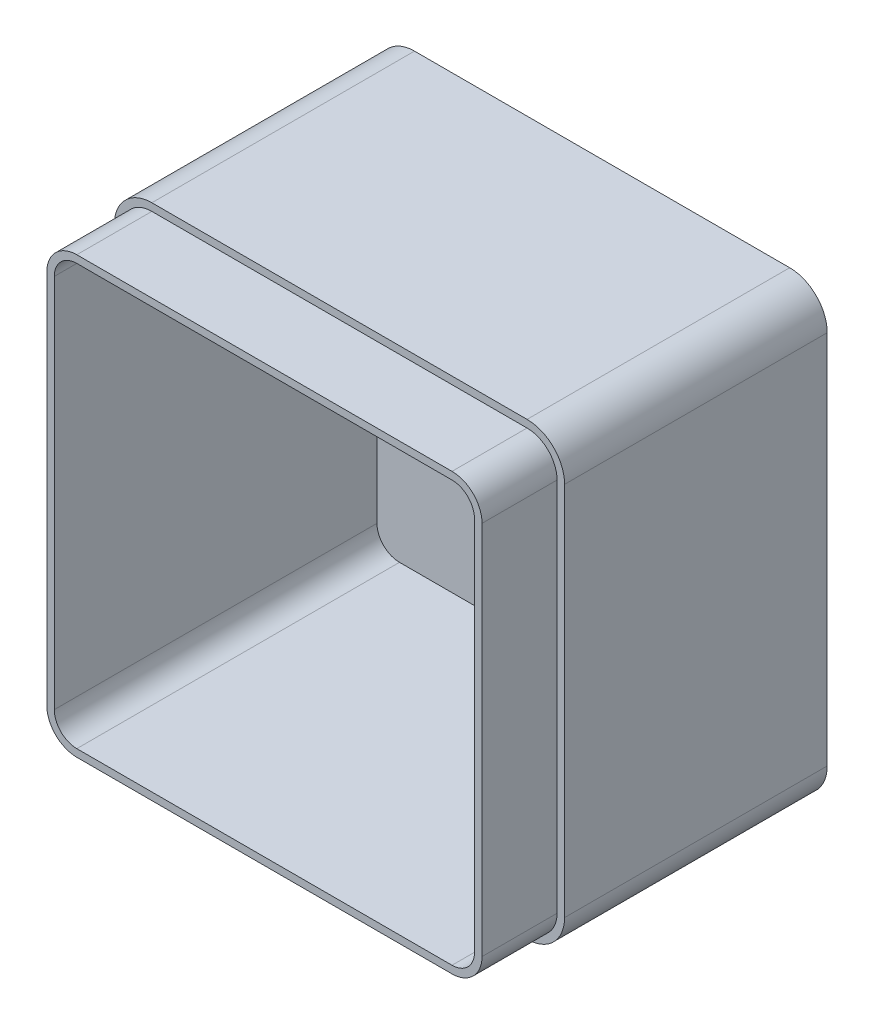
ISO-10303-21;
HEADER;
FILE_DESCRIPTION(('STEP AP214'),'2;1');
FILE_NAME('part.step','',(''),(''),'','','');
FILE_SCHEMA(('AUTOMOTIVE_DESIGN { 1 0 10303 214 1 1 1 1 }'));
ENDSEC;
DATA;
#1=APPLICATION_CONTEXT('core data for automotive mechanical design processes');
#2=APPLICATION_PROTOCOL_DEFINITION('international standard','automotive_design',2000,#1);
#3=PRODUCT_CONTEXT('',#1,'mechanical');
#4=PRODUCT('Part','Part','',(#3));
#5=PRODUCT_RELATED_PRODUCT_CATEGORY('part','',(#4));
#6=PRODUCT_DEFINITION_FORMATION('','',#4);
#7=PRODUCT_DEFINITION_CONTEXT('part definition',#1,'design');
#8=PRODUCT_DEFINITION('design','',#6,#7);
#9=PRODUCT_DEFINITION_SHAPE('','',#8);
#10=(LENGTH_UNIT() NAMED_UNIT(*) SI_UNIT(.MILLI.,.METRE.));
#11=(NAMED_UNIT(*) PLANE_ANGLE_UNIT() SI_UNIT($,.RADIAN.));
#12=(NAMED_UNIT(*) SI_UNIT($,.STERADIAN.) SOLID_ANGLE_UNIT());
#13=UNCERTAINTY_MEASURE_WITH_UNIT(LENGTH_MEASURE(1.E-05),#10,'distance_accuracy_value','');
#14=(GEOMETRIC_REPRESENTATION_CONTEXT(3) GLOBAL_UNCERTAINTY_ASSIGNED_CONTEXT((#13)) GLOBAL_UNIT_ASSIGNED_CONTEXT((#10,
#11,#12)) REPRESENTATION_CONTEXT('',''));
#15=CARTESIAN_POINT('',(0.,0.,0.));
#16=DIRECTION('',(0.,0.,1.));
#17=DIRECTION('',(1.,0.,0.));
#18=AXIS2_PLACEMENT_3D('',#15,#16,#17);
#19=CARTESIAN_POINT('',(0.,0.,90.));
#20=DIRECTION('',(0.,0.,-1.));
#21=DIRECTION('',(-1.,0.,0.));
#22=AXIS2_PLACEMENT_3D('',#19,#20,#21);
#23=PLANE('',#22);
#24=DIRECTION('',(0.,-1.,0.));
#25=VECTOR('',#24,1.);
#26=CARTESIAN_POINT('',(4.,0.,90.));
#27=LINE('',#26,#25);
#28=CARTESIAN_POINT('',(3.99999999999997,110.,90.));
#29=VERTEX_POINT('',#28);
#30=CARTESIAN_POINT('',(4.,10.,90.));
#31=VERTEX_POINT('',#30);
#32=EDGE_CURVE('E347',#29,#31,#27,.T.);
#33=ORIENTED_EDGE('',*,*,#32,.F.);
#34=CARTESIAN_POINT('',(9.99999999999997,110.,90.));
#35=DIRECTION('',(0.,0.,-1.));
#36=DIRECTION('',(-1.,0.,0.));
#37=AXIS2_PLACEMENT_3D('',#34,#35,#36);
#38=CIRCLE('',#37,6.);
#39=CARTESIAN_POINT('',(9.99999999999997,116.,90.));
#40=VERTEX_POINT('',#39);
#41=EDGE_CURVE('E387',#40,#29,#38,.F.);
#42=ORIENTED_EDGE('',*,*,#41,.F.);
#43=DIRECTION('',(-1.,0.,0.));
#44=VECTOR('',#43,1.);
#45=CARTESIAN_POINT('',(0.,116.,90.));
#46=LINE('',#45,#44);
#47=CARTESIAN_POINT('',(110.,116.,90.));
#48=VERTEX_POINT('',#47);
#49=EDGE_CURVE('E363',#48,#40,#46,.T.);
#50=ORIENTED_EDGE('',*,*,#49,.F.);
#51=CARTESIAN_POINT('',(110.,110.,90.));
#52=DIRECTION('',(0.,0.,-1.));
#53=DIRECTION('',(-1.,0.,0.));
#54=AXIS2_PLACEMENT_3D('',#51,#52,#53);
#55=CIRCLE('',#54,6.);
#56=CARTESIAN_POINT('',(116.,110.,90.));
#57=VERTEX_POINT('',#56);
#58=EDGE_CURVE('E327',#57,#48,#55,.F.);
#59=ORIENTED_EDGE('',*,*,#58,.F.);
#60=DIRECTION('',(0.,1.,0.));
#61=VECTOR('',#60,1.);
#62=CARTESIAN_POINT('',(116.,0.,90.));
#63=LINE('',#62,#61);
#64=CARTESIAN_POINT('',(116.,10.,90.));
#65=VERTEX_POINT('',#64);
#66=EDGE_CURVE('E391',#65,#57,#63,.T.);
#67=ORIENTED_EDGE('',*,*,#66,.F.);
#68=CARTESIAN_POINT('',(110.,10.,90.));
#69=DIRECTION('',(0.,0.,-1.));
#70=DIRECTION('',(-1.,0.,0.));
#71=AXIS2_PLACEMENT_3D('',#68,#69,#70);
#72=CIRCLE('',#71,6.);
#73=CARTESIAN_POINT('',(110.,4.,90.));
#74=VERTEX_POINT('',#73);
#75=EDGE_CURVE('E392',#74,#65,#72,.F.);
#76=ORIENTED_EDGE('',*,*,#75,.F.);
#77=DIRECTION('',(1.,0.,0.));
#78=VECTOR('',#77,1.);
#79=CARTESIAN_POINT('',(0.,4.,90.));
#80=LINE('',#79,#78);
#81=CARTESIAN_POINT('',(9.99999999999999,4.,90.));
#82=VERTEX_POINT('',#81);
#83=EDGE_CURVE('E384',#82,#74,#80,.T.);
#84=ORIENTED_EDGE('',*,*,#83,.F.);
#85=CARTESIAN_POINT('',(9.99999999999999,10.,90.));
#86=DIRECTION('',(0.,0.,-1.));
#87=DIRECTION('',(-1.,0.,0.));
#88=AXIS2_PLACEMENT_3D('',#85,#86,#87);
#89=CIRCLE('',#88,6.);
#90=EDGE_CURVE('E377',#31,#82,#89,.F.);
#91=ORIENTED_EDGE('',*,*,#90,.F.);
#92=EDGE_LOOP('',(#33,#42,#50,#59,#67,#76,#84,#91));
#93=FACE_BOUND('',#92,.T.);
#94=CARTESIAN_POINT('',(9.99999999999997,110.,90.));
#95=DIRECTION('',(0.,0.,1.));
#96=DIRECTION('',(1.,0.,0.));
#97=AXIS2_PLACEMENT_3D('',#94,#95,#96);
#98=CIRCLE('',#97,8.);
#99=CARTESIAN_POINT('',(9.99999999999997,118.,90.));
#100=VERTEX_POINT('',#99);
#101=CARTESIAN_POINT('',(1.99999999999997,110.,90.));
#102=VERTEX_POINT('',#101);
#103=EDGE_CURVE('E255',#100,#102,#98,.T.);
#104=ORIENTED_EDGE('',*,*,#103,.T.);
#105=DIRECTION('',(0.,-1.,0.));
#106=VECTOR('',#105,1.);
#107=CARTESIAN_POINT('',(1.99999999999997,110.,90.));
#108=LINE('',#107,#106);
#109=CARTESIAN_POINT('',(1.99999999999997,9.99999999999999,90.));
#110=VERTEX_POINT('',#109);
#111=EDGE_CURVE('E205',#102,#110,#108,.T.);
#112=ORIENTED_EDGE('',*,*,#111,.T.);
#113=CARTESIAN_POINT('',(9.99999999999999,10.,90.));
#114=DIRECTION('',(0.,0.,1.));
#115=DIRECTION('',(1.,0.,0.));
#116=AXIS2_PLACEMENT_3D('',#113,#114,#115);
#117=CIRCLE('',#116,8.00000000000001);
#118=CARTESIAN_POINT('',(9.99999999999999,1.99999999999999,90.));
#119=VERTEX_POINT('',#118);
#120=EDGE_CURVE('E54',#110,#119,#117,.T.);
#121=ORIENTED_EDGE('',*,*,#120,.T.);
#122=DIRECTION('',(1.,0.,0.));
#123=VECTOR('',#122,1.);
#124=CARTESIAN_POINT('',(9.99999999999999,2.,90.));
#125=LINE('',#124,#123);
#126=CARTESIAN_POINT('',(110.,2.,90.));
#127=VERTEX_POINT('',#126);
#128=EDGE_CURVE('E262',#119,#127,#125,.T.);
#129=ORIENTED_EDGE('',*,*,#128,.T.);
#130=CARTESIAN_POINT('',(110.,10.,90.));
#131=DIRECTION('',(0.,0.,1.));
#132=DIRECTION('',(1.,0.,0.));
#133=AXIS2_PLACEMENT_3D('',#130,#131,#132);
#134=CIRCLE('',#133,7.99999999999999);
#135=CARTESIAN_POINT('',(118.,10.,90.));
#136=VERTEX_POINT('',#135);
#137=EDGE_CURVE('E266',#127,#136,#134,.T.);
#138=ORIENTED_EDGE('',*,*,#137,.T.);
#139=DIRECTION('',(0.,1.,0.));
#140=VECTOR('',#139,1.);
#141=CARTESIAN_POINT('',(118.,9.99999999999999,90.));
#142=LINE('',#141,#140);
#143=CARTESIAN_POINT('',(118.,110.,90.));
#144=VERTEX_POINT('',#143);
#145=EDGE_CURVE('E270',#136,#144,#142,.T.);
#146=ORIENTED_EDGE('',*,*,#145,.T.);
#147=CARTESIAN_POINT('',(110.,110.,90.));
#148=DIRECTION('',(0.,0.,1.));
#149=DIRECTION('',(1.,0.,0.));
#150=AXIS2_PLACEMENT_3D('',#147,#148,#149);
#151=CIRCLE('',#150,8.00000000000001);
#152=CARTESIAN_POINT('',(110.,118.,90.));
#153=VERTEX_POINT('',#152);
#154=EDGE_CURVE('E232',#144,#153,#151,.T.);
#155=ORIENTED_EDGE('',*,*,#154,.T.);
#156=DIRECTION('',(-1.,0.,0.));
#157=VECTOR('',#156,1.);
#158=CARTESIAN_POINT('',(110.,118.,90.));
#159=LINE('',#158,#157);
#160=EDGE_CURVE('E228',#153,#100,#159,.T.);
#161=ORIENTED_EDGE('',*,*,#160,.T.);
#162=EDGE_LOOP('',(#104,#112,#121,#129,#138,#146,#155,#161));
#163=FACE_BOUND('',#162,.T.);
#164=ADVANCED_FACE('F38',(#93,#163),#23,.F.);
#165=CARTESIAN_POINT('',(4.,0.,90.));
#166=DIRECTION('',(1.,0.,0.));
#167=DIRECTION('',(0.,1.,0.));
#168=AXIS2_PLACEMENT_3D('',#165,#166,#167);
#169=PLANE('',#168);
#170=DIRECTION('',(0.,-1.,0.));
#171=VECTOR('',#170,1.);
#172=CARTESIAN_POINT('',(4.,0.,4.));
#173=LINE('',#172,#171);
#174=CARTESIAN_POINT('',(3.99999999999997,110.,4.));
#175=VERTEX_POINT('',#174);
#176=CARTESIAN_POINT('',(4.,10.,4.));
#177=VERTEX_POINT('',#176);
#178=EDGE_CURVE('E319',#175,#177,#173,.T.);
#179=ORIENTED_EDGE('',*,*,#178,.F.);
#180=DIRECTION('',(0.,0.,1.));
#181=VECTOR('',#180,1.);
#182=CARTESIAN_POINT('',(3.99999999999997,110.,90.));
#183=LINE('',#182,#181);
#184=EDGE_CURVE('E328',#29,#175,#183,.F.);
#185=ORIENTED_EDGE('',*,*,#184,.F.);
#186=ORIENTED_EDGE('',*,*,#32,.T.);
#187=DIRECTION('',(0.,0.,1.));
#188=VECTOR('',#187,1.);
#189=CARTESIAN_POINT('',(4.,10.,90.));
#190=LINE('',#189,#188);
#191=EDGE_CURVE('E324',#177,#31,#190,.T.);
#192=ORIENTED_EDGE('',*,*,#191,.F.);
#193=EDGE_LOOP('',(#179,#185,#186,#192));
#194=FACE_BOUND('',#193,.T.);
#195=ADVANCED_FACE('F504',(#194),#169,.T.);
#196=CARTESIAN_POINT('',(0.,4.,90.));
#197=DIRECTION('',(0.,1.,0.));
#198=DIRECTION('',(0.,0.,1.));
#199=AXIS2_PLACEMENT_3D('',#196,#197,#198);
#200=PLANE('',#199);
#201=ORIENTED_EDGE('',*,*,#83,.T.);
#202=DIRECTION('',(0.,0.,1.));
#203=VECTOR('',#202,1.);
#204=CARTESIAN_POINT('',(110.,4.,90.));
#205=LINE('',#204,#203);
#206=CARTESIAN_POINT('',(110.,4.,4.));
#207=VERTEX_POINT('',#206);
#208=EDGE_CURVE('E360',#207,#74,#205,.T.);
#209=ORIENTED_EDGE('',*,*,#208,.F.);
#210=DIRECTION('',(1.,0.,0.));
#211=VECTOR('',#210,1.);
#212=CARTESIAN_POINT('',(0.,4.,4.));
#213=LINE('',#212,#211);
#214=CARTESIAN_POINT('',(9.99999999999999,4.,4.));
#215=VERTEX_POINT('',#214);
#216=EDGE_CURVE('E323',#215,#207,#213,.T.);
#217=ORIENTED_EDGE('',*,*,#216,.F.);
#218=DIRECTION('',(0.,0.,1.));
#219=VECTOR('',#218,1.);
#220=CARTESIAN_POINT('',(9.99999999999999,4.,90.));
#221=LINE('',#220,#219);
#222=EDGE_CURVE('E351',#82,#215,#221,.F.);
#223=ORIENTED_EDGE('',*,*,#222,.F.);
#224=EDGE_LOOP('',(#201,#209,#217,#223));
#225=FACE_BOUND('',#224,.T.);
#226=ADVANCED_FACE('F509',(#225),#200,.T.);
#227=CARTESIAN_POINT('',(116.,0.,90.));
#228=DIRECTION('',(-1.,0.,0.));
#229=DIRECTION('',(0.,-1.,0.));
#230=AXIS2_PLACEMENT_3D('',#227,#228,#229);
#231=PLANE('',#230);
#232=ORIENTED_EDGE('',*,*,#66,.T.);
#233=DIRECTION('',(0.,0.,1.));
#234=VECTOR('',#233,1.);
#235=CARTESIAN_POINT('',(116.,110.,90.));
#236=LINE('',#235,#234);
#237=CARTESIAN_POINT('',(116.,110.,4.));
#238=VERTEX_POINT('',#237);
#239=EDGE_CURVE('E369',#238,#57,#236,.T.);
#240=ORIENTED_EDGE('',*,*,#239,.F.);
#241=DIRECTION('',(0.,1.,0.));
#242=VECTOR('',#241,1.);
#243=CARTESIAN_POINT('',(116.,0.,4.));
#244=LINE('',#243,#242);
#245=CARTESIAN_POINT('',(116.,10.,4.));
#246=VERTEX_POINT('',#245);
#247=EDGE_CURVE('E336',#246,#238,#244,.T.);
#248=ORIENTED_EDGE('',*,*,#247,.F.);
#249=DIRECTION('',(0.,0.,1.));
#250=VECTOR('',#249,1.);
#251=CARTESIAN_POINT('',(116.,10.,90.));
#252=LINE('',#251,#250);
#253=EDGE_CURVE('E364',#65,#246,#252,.F.);
#254=ORIENTED_EDGE('',*,*,#253,.F.);
#255=EDGE_LOOP('',(#232,#240,#248,#254));
#256=FACE_BOUND('',#255,.T.);
#257=ADVANCED_FACE('F538',(#256),#231,.T.);
#258=CARTESIAN_POINT('',(0.,116.,90.));
#259=DIRECTION('',(0.,-1.,0.));
#260=DIRECTION('',(0.,0.,-1.));
#261=AXIS2_PLACEMENT_3D('',#258,#259,#260);
#262=PLANE('',#261);
#263=DIRECTION('',(-1.,0.,0.));
#264=VECTOR('',#263,1.);
#265=CARTESIAN_POINT('',(0.,116.,4.));
#266=LINE('',#265,#264);
#267=CARTESIAN_POINT('',(110.,116.,4.));
#268=VERTEX_POINT('',#267);
#269=CARTESIAN_POINT('',(9.99999999999997,116.,4.));
#270=VERTEX_POINT('',#269);
#271=EDGE_CURVE('E343',#268,#270,#266,.T.);
#272=ORIENTED_EDGE('',*,*,#271,.F.);
#273=DIRECTION('',(0.,0.,-1.));
#274=VECTOR('',#273,1.);
#275=CARTESIAN_POINT('',(110.,116.,90.));
#276=LINE('',#275,#274);
#277=EDGE_CURVE('E373',#48,#268,#276,.T.);
#278=ORIENTED_EDGE('',*,*,#277,.F.);
#279=ORIENTED_EDGE('',*,*,#49,.T.);
#280=DIRECTION('',(0.,0.,-1.));
#281=VECTOR('',#280,1.);
#282=CARTESIAN_POINT('',(9.99999999999997,116.,90.));
#283=LINE('',#282,#281);
#284=EDGE_CURVE('E372',#270,#40,#283,.F.);
#285=ORIENTED_EDGE('',*,*,#284,.F.);
#286=EDGE_LOOP('',(#272,#278,#279,#285));
#287=FACE_BOUND('',#286,.T.);
#288=ADVANCED_FACE('F534',(#287),#262,.T.);
#289=CARTESIAN_POINT('',(0.,0.,4.));
#290=DIRECTION('',(0.,0.,-1.));
#291=DIRECTION('',(-1.,0.,0.));
#292=AXIS2_PLACEMENT_3D('',#289,#290,#291);
#293=PLANE('',#292);
#294=ORIENTED_EDGE('',*,*,#216,.T.);
#295=CARTESIAN_POINT('',(110.,10.,4.));
#296=DIRECTION('',(0.,0.,-1.));
#297=DIRECTION('',(-1.,0.,0.));
#298=AXIS2_PLACEMENT_3D('',#295,#296,#297);
#299=CIRCLE('',#298,6.);
#300=EDGE_CURVE('E342',#246,#207,#299,.T.);
#301=ORIENTED_EDGE('',*,*,#300,.F.);
#302=ORIENTED_EDGE('',*,*,#247,.T.);
#303=CARTESIAN_POINT('',(110.,110.,4.));
#304=DIRECTION('',(0.,0.,-1.));
#305=DIRECTION('',(-1.,0.,0.));
#306=AXIS2_PLACEMENT_3D('',#303,#304,#305);
#307=CIRCLE('',#306,6.);
#308=EDGE_CURVE('E348',#268,#238,#307,.T.);
#309=ORIENTED_EDGE('',*,*,#308,.F.);
#310=ORIENTED_EDGE('',*,*,#271,.T.);
#311=CARTESIAN_POINT('',(9.99999999999997,110.,4.));
#312=DIRECTION('',(0.,0.,-1.));
#313=DIRECTION('',(-1.,0.,0.));
#314=AXIS2_PLACEMENT_3D('',#311,#312,#313);
#315=CIRCLE('',#314,6.);
#316=EDGE_CURVE('E339',#175,#270,#315,.T.);
#317=ORIENTED_EDGE('',*,*,#316,.F.);
#318=ORIENTED_EDGE('',*,*,#178,.T.);
#319=CARTESIAN_POINT('',(9.99999999999999,10.,4.));
#320=DIRECTION('',(0.,0.,-1.));
#321=DIRECTION('',(-1.,0.,0.));
#322=AXIS2_PLACEMENT_3D('',#319,#320,#321);
#323=CIRCLE('',#322,6.);
#324=EDGE_CURVE('E332',#215,#177,#323,.T.);
#325=ORIENTED_EDGE('',*,*,#324,.F.);
#326=EDGE_LOOP('',(#294,#301,#302,#309,#310,#317,#318,#325));
#327=FACE_BOUND('',#326,.T.);
#328=ADVANCED_FACE('F530',(#327),#293,.F.);
#329=CARTESIAN_POINT('',(9.99999999999999,10.,90.));
#330=DIRECTION('',(0.,0.,-1.));
#331=DIRECTION('',(-1.,0.,0.));
#332=AXIS2_PLACEMENT_3D('',#329,#330,#331);
#333=CYLINDRICAL_SURFACE('',#332,6.);
#334=ORIENTED_EDGE('',*,*,#90,.T.);
#335=ORIENTED_EDGE('',*,*,#222,.T.);
#336=ORIENTED_EDGE('',*,*,#324,.T.);
#337=ORIENTED_EDGE('',*,*,#191,.T.);
#338=EDGE_LOOP('',(#334,#335,#336,#337));
#339=FACE_BOUND('',#338,.T.);
#340=ADVANCED_FACE('F526',(#339),#333,.F.);
#341=CARTESIAN_POINT('',(9.99999999999997,110.,90.));
#342=DIRECTION('',(0.,0.,-1.));
#343=DIRECTION('',(-1.,0.,0.));
#344=AXIS2_PLACEMENT_3D('',#341,#342,#343);
#345=CYLINDRICAL_SURFACE('',#344,6.);
#346=ORIENTED_EDGE('',*,*,#41,.T.);
#347=ORIENTED_EDGE('',*,*,#184,.T.);
#348=ORIENTED_EDGE('',*,*,#316,.T.);
#349=ORIENTED_EDGE('',*,*,#284,.T.);
#350=EDGE_LOOP('',(#346,#347,#348,#349));
#351=FACE_BOUND('',#350,.T.);
#352=ADVANCED_FACE('F522',(#351),#345,.F.);
#353=CARTESIAN_POINT('',(110.,10.,90.));
#354=DIRECTION('',(0.,0.,-1.));
#355=DIRECTION('',(-1.,0.,0.));
#356=AXIS2_PLACEMENT_3D('',#353,#354,#355);
#357=CYLINDRICAL_SURFACE('',#356,6.);
#358=ORIENTED_EDGE('',*,*,#75,.T.);
#359=ORIENTED_EDGE('',*,*,#253,.T.);
#360=ORIENTED_EDGE('',*,*,#300,.T.);
#361=ORIENTED_EDGE('',*,*,#208,.T.);
#362=EDGE_LOOP('',(#358,#359,#360,#361));
#363=FACE_BOUND('',#362,.T.);
#364=ADVANCED_FACE('F518',(#363),#357,.F.);
#365=CARTESIAN_POINT('',(110.,110.,90.));
#366=DIRECTION('',(0.,0.,-1.));
#367=DIRECTION('',(-1.,0.,0.));
#368=AXIS2_PLACEMENT_3D('',#365,#366,#367);
#369=CYLINDRICAL_SURFACE('',#368,6.);
#370=ORIENTED_EDGE('',*,*,#58,.T.);
#371=ORIENTED_EDGE('',*,*,#277,.T.);
#372=ORIENTED_EDGE('',*,*,#308,.T.);
#373=ORIENTED_EDGE('',*,*,#239,.T.);
#374=EDGE_LOOP('',(#370,#371,#372,#373));
#375=FACE_BOUND('',#374,.T.);
#376=ADVANCED_FACE('F515',(#375),#369,.F.);
#377=CARTESIAN_POINT('',(9.99999999999997,110.,70.));
#378=DIRECTION('',(0.,0.,1.));
#379=DIRECTION('',(1.,0.,0.));
#380=AXIS2_PLACEMENT_3D('',#377,#378,#379);
#381=PLANE('',#380);
#382=DIRECTION('',(-1.,0.,0.));
#383=VECTOR('',#382,1.);
#384=CARTESIAN_POINT('',(110.,118.,70.));
#385=LINE('',#384,#383);
#386=CARTESIAN_POINT('',(110.,118.,70.));
#387=VERTEX_POINT('',#386);
#388=CARTESIAN_POINT('',(9.99999999999997,118.,70.));
#389=VERTEX_POINT('',#388);
#390=EDGE_CURVE('E212',#387,#389,#385,.T.);
#391=ORIENTED_EDGE('',*,*,#390,.F.);
#392=CARTESIAN_POINT('',(110.,110.,70.));
#393=DIRECTION('',(0.,0.,1.));
#394=DIRECTION('',(1.,0.,0.));
#395=AXIS2_PLACEMENT_3D('',#392,#393,#394);
#396=CIRCLE('',#395,8.00000000000001);
#397=CARTESIAN_POINT('',(118.,110.,70.));
#398=VERTEX_POINT('',#397);
#399=EDGE_CURVE('E249',#398,#387,#396,.T.);
#400=ORIENTED_EDGE('',*,*,#399,.F.);
#401=DIRECTION('',(0.,1.,0.));
#402=VECTOR('',#401,1.);
#403=CARTESIAN_POINT('',(118.,9.99999999999999,70.));
#404=LINE('',#403,#402);
#405=CARTESIAN_POINT('',(118.,10.,70.));
#406=VERTEX_POINT('',#405);
#407=EDGE_CURVE('E245',#406,#398,#404,.T.);
#408=ORIENTED_EDGE('',*,*,#407,.F.);
#409=CARTESIAN_POINT('',(110.,10.,70.));
#410=DIRECTION('',(0.,0.,1.));
#411=DIRECTION('',(1.,0.,0.));
#412=AXIS2_PLACEMENT_3D('',#409,#410,#411);
#413=CIRCLE('',#412,7.99999999999999);
#414=CARTESIAN_POINT('',(110.,2.,70.));
#415=VERTEX_POINT('',#414);
#416=EDGE_CURVE('E241',#415,#406,#413,.T.);
#417=ORIENTED_EDGE('',*,*,#416,.F.);
#418=DIRECTION('',(1.,0.,0.));
#419=VECTOR('',#418,1.);
#420=CARTESIAN_POINT('',(9.99999999999999,2.,70.));
#421=LINE('',#420,#419);
#422=CARTESIAN_POINT('',(9.99999999999999,1.99999999999999,70.));
#423=VERTEX_POINT('',#422);
#424=EDGE_CURVE('E237',#423,#415,#421,.T.);
#425=ORIENTED_EDGE('',*,*,#424,.F.);
#426=CARTESIAN_POINT('',(9.99999999999999,10.,70.));
#427=DIRECTION('',(0.,0.,1.));
#428=DIRECTION('',(1.,0.,0.));
#429=AXIS2_PLACEMENT_3D('',#426,#427,#428);
#430=CIRCLE('',#429,8.00000000000001);
#431=CARTESIAN_POINT('',(1.99999999999997,9.99999999999999,70.));
#432=VERTEX_POINT('',#431);
#433=EDGE_CURVE('E222',#432,#423,#430,.T.);
#434=ORIENTED_EDGE('',*,*,#433,.F.);
#435=DIRECTION('',(0.,-1.,0.));
#436=VECTOR('',#435,1.);
#437=CARTESIAN_POINT('',(1.99999999999997,110.,70.));
#438=LINE('',#437,#436);
#439=CARTESIAN_POINT('',(1.99999999999997,110.,70.));
#440=VERTEX_POINT('',#439);
#441=EDGE_CURVE('E203',#440,#432,#438,.T.);
#442=ORIENTED_EDGE('',*,*,#441,.F.);
#443=CARTESIAN_POINT('',(9.99999999999997,110.,70.));
#444=DIRECTION('',(0.,0.,1.));
#445=DIRECTION('',(1.,0.,0.));
#446=AXIS2_PLACEMENT_3D('',#443,#444,#445);
#447=CIRCLE('',#446,8.);
#448=EDGE_CURVE('E218',#389,#440,#447,.T.);
#449=ORIENTED_EDGE('',*,*,#448,.F.);
#450=EDGE_LOOP('',(#391,#400,#408,#417,#425,#434,#442,#449));
#451=FACE_BOUND('',#450,.T.);
#452=CARTESIAN_POINT('',(9.99999999999997,110.,70.));
#453=DIRECTION('',(0.,0.,1.));
#454=DIRECTION('',(1.,0.,0.));
#455=AXIS2_PLACEMENT_3D('',#452,#453,#454);
#456=CIRCLE('',#455,10.);
#457=CARTESIAN_POINT('',(9.99999999999997,120.,70.));
#458=VERTEX_POINT('',#457);
#459=CARTESIAN_POINT('',(0.,110.,70.));
#460=VERTEX_POINT('',#459);
#461=EDGE_CURVE('E279',#458,#460,#456,.T.);
#462=ORIENTED_EDGE('',*,*,#461,.T.);
#463=DIRECTION('',(0.,-1.,0.));
#464=VECTOR('',#463,1.);
#465=CARTESIAN_POINT('',(0.,110.,70.));
#466=LINE('',#465,#464);
#467=CARTESIAN_POINT('',(0.,10.,70.));
#468=VERTEX_POINT('',#467);
#469=EDGE_CURVE('E299',#460,#468,#466,.T.);
#470=ORIENTED_EDGE('',*,*,#469,.T.);
#471=CARTESIAN_POINT('',(9.99999999999999,10.,70.));
#472=DIRECTION('',(0.,0.,1.));
#473=DIRECTION('',(1.,0.,0.));
#474=AXIS2_PLACEMENT_3D('',#471,#472,#473);
#475=CIRCLE('',#474,10.);
#476=CARTESIAN_POINT('',(9.99999999999999,0.,70.));
#477=VERTEX_POINT('',#476);
#478=EDGE_CURVE('E302',#468,#477,#475,.T.);
#479=ORIENTED_EDGE('',*,*,#478,.T.);
#480=DIRECTION('',(1.,0.,0.));
#481=VECTOR('',#480,1.);
#482=CARTESIAN_POINT('',(9.99999999999999,0.,70.));
#483=LINE('',#482,#481);
#484=CARTESIAN_POINT('',(110.,0.,70.));
#485=VERTEX_POINT('',#484);
#486=EDGE_CURVE('E305',#477,#485,#483,.T.);
#487=ORIENTED_EDGE('',*,*,#486,.T.);
#488=CARTESIAN_POINT('',(110.,10.,70.));
#489=DIRECTION('',(0.,0.,1.));
#490=DIRECTION('',(1.,0.,0.));
#491=AXIS2_PLACEMENT_3D('',#488,#489,#490);
#492=CIRCLE('',#491,9.99999999999999);
#493=CARTESIAN_POINT('',(120.,10.,70.));
#494=VERTEX_POINT('',#493);
#495=EDGE_CURVE('E308',#485,#494,#492,.T.);
#496=ORIENTED_EDGE('',*,*,#495,.T.);
#497=DIRECTION('',(0.,1.,0.));
#498=VECTOR('',#497,1.);
#499=CARTESIAN_POINT('',(120.,10.,70.));
#500=LINE('',#499,#498);
#501=CARTESIAN_POINT('',(120.,110.,70.));
#502=VERTEX_POINT('',#501);
#503=EDGE_CURVE('E62',#494,#502,#500,.T.);
#504=ORIENTED_EDGE('',*,*,#503,.T.);
#505=CARTESIAN_POINT('',(110.,110.,70.));
#506=DIRECTION('',(0.,0.,1.));
#507=DIRECTION('',(1.,0.,0.));
#508=AXIS2_PLACEMENT_3D('',#505,#506,#507);
#509=CIRCLE('',#508,9.99999999999999);
#510=CARTESIAN_POINT('',(110.,120.,70.));
#511=VERTEX_POINT('',#510);
#512=EDGE_CURVE('E313',#502,#511,#509,.T.);
#513=ORIENTED_EDGE('',*,*,#512,.T.);
#514=DIRECTION('',(-1.,0.,0.));
#515=VECTOR('',#514,1.);
#516=CARTESIAN_POINT('',(110.,120.,70.));
#517=LINE('',#516,#515);
#518=EDGE_CURVE('E316',#511,#458,#517,.T.);
#519=ORIENTED_EDGE('',*,*,#518,.T.);
#520=EDGE_LOOP('',(#462,#470,#479,#487,#496,#504,#513,#519));
#521=FACE_BOUND('',#520,.T.);
#522=ADVANCED_FACE('F217',(#451,#521),#381,.T.);
#523=CARTESIAN_POINT('',(9.99999999999997,110.,70.));
#524=DIRECTION('',(0.,0.,1.));
#525=DIRECTION('',(1.,0.,0.));
#526=AXIS2_PLACEMENT_3D('',#523,#524,#525);
#527=CYLINDRICAL_SURFACE('',#526,8.);
#528=ORIENTED_EDGE('',*,*,#103,.F.);
#529=DIRECTION('',(0.,0.,1.));
#530=VECTOR('',#529,1.);
#531=CARTESIAN_POINT('',(9.99999999999997,118.,70.));
#532=LINE('',#531,#530);
#533=EDGE_CURVE('E226',#389,#100,#532,.T.);
#534=ORIENTED_EDGE('',*,*,#533,.F.);
#535=ORIENTED_EDGE('',*,*,#448,.T.);
#536=DIRECTION('',(0.,0.,1.));
#537=VECTOR('',#536,1.);
#538=CARTESIAN_POINT('',(1.99999999999997,110.,70.));
#539=LINE('',#538,#537);
#540=EDGE_CURVE('E200',#440,#102,#539,.T.);
#541=ORIENTED_EDGE('',*,*,#540,.T.);
#542=EDGE_LOOP('',(#528,#534,#535,#541));
#543=FACE_BOUND('',#542,.T.);
#544=ADVANCED_FACE('F225',(#543),#527,.T.);
#545=CARTESIAN_POINT('',(110.,118.,70.));
#546=DIRECTION('',(0.,1.,0.));
#547=DIRECTION('',(0.,0.,1.));
#548=AXIS2_PLACEMENT_3D('',#545,#546,#547);
#549=PLANE('',#548);
#550=ORIENTED_EDGE('',*,*,#160,.F.);
#551=DIRECTION('',(0.,0.,1.));
#552=VECTOR('',#551,1.);
#553=CARTESIAN_POINT('',(110.,118.,70.));
#554=LINE('',#553,#552);
#555=EDGE_CURVE('E280',#387,#153,#554,.T.);
#556=ORIENTED_EDGE('',*,*,#555,.F.);
#557=ORIENTED_EDGE('',*,*,#390,.T.);
#558=ORIENTED_EDGE('',*,*,#533,.T.);
#559=EDGE_LOOP('',(#550,#556,#557,#558));
#560=FACE_BOUND('',#559,.T.);
#561=ADVANCED_FACE('F549',(#560),#549,.T.);
#562=CARTESIAN_POINT('',(110.,110.,70.));
#563=DIRECTION('',(0.,0.,1.));
#564=DIRECTION('',(1.,0.,0.));
#565=AXIS2_PLACEMENT_3D('',#562,#563,#564);
#566=CYLINDRICAL_SURFACE('',#565,8.00000000000001);
#567=ORIENTED_EDGE('',*,*,#154,.F.);
#568=DIRECTION('',(0.,0.,1.));
#569=VECTOR('',#568,1.);
#570=CARTESIAN_POINT('',(118.,110.,70.));
#571=LINE('',#570,#569);
#572=EDGE_CURVE('E283',#398,#144,#571,.T.);
#573=ORIENTED_EDGE('',*,*,#572,.F.);
#574=ORIENTED_EDGE('',*,*,#399,.T.);
#575=ORIENTED_EDGE('',*,*,#555,.T.);
#576=EDGE_LOOP('',(#567,#573,#574,#575));
#577=FACE_BOUND('',#576,.T.);
#578=ADVANCED_FACE('F564',(#577),#566,.T.);
#579=CARTESIAN_POINT('',(118.,9.99999999999999,70.));
#580=DIRECTION('',(1.,0.,0.));
#581=DIRECTION('',(0.,0.,-1.));
#582=AXIS2_PLACEMENT_3D('',#579,#580,#581);
#583=PLANE('',#582);
#584=ORIENTED_EDGE('',*,*,#145,.F.);
#585=DIRECTION('',(0.,0.,1.));
#586=VECTOR('',#585,1.);
#587=CARTESIAN_POINT('',(118.,10.,70.));
#588=LINE('',#587,#586);
#589=EDGE_CURVE('E286',#406,#136,#588,.T.);
#590=ORIENTED_EDGE('',*,*,#589,.F.);
#591=ORIENTED_EDGE('',*,*,#407,.T.);
#592=ORIENTED_EDGE('',*,*,#572,.T.);
#593=EDGE_LOOP('',(#584,#590,#591,#592));
#594=FACE_BOUND('',#593,.T.);
#595=ADVANCED_FACE('F560',(#594),#583,.T.);
#596=CARTESIAN_POINT('',(110.,10.,70.));
#597=DIRECTION('',(0.,0.,1.));
#598=DIRECTION('',(1.,0.,0.));
#599=AXIS2_PLACEMENT_3D('',#596,#597,#598);
#600=CYLINDRICAL_SURFACE('',#599,7.99999999999999);
#601=ORIENTED_EDGE('',*,*,#137,.F.);
#602=DIRECTION('',(0.,0.,1.));
#603=VECTOR('',#602,1.);
#604=CARTESIAN_POINT('',(110.,2.,70.));
#605=LINE('',#604,#603);
#606=EDGE_CURVE('E289',#415,#127,#605,.T.);
#607=ORIENTED_EDGE('',*,*,#606,.F.);
#608=ORIENTED_EDGE('',*,*,#416,.T.);
#609=ORIENTED_EDGE('',*,*,#589,.T.);
#610=EDGE_LOOP('',(#601,#607,#608,#609));
#611=FACE_BOUND('',#610,.T.);
#612=ADVANCED_FACE('F556',(#611),#600,.T.);
#613=CARTESIAN_POINT('',(9.99999999999999,2.,70.));
#614=DIRECTION('',(0.,-1.,0.));
#615=DIRECTION('',(0.,0.,-1.));
#616=AXIS2_PLACEMENT_3D('',#613,#614,#615);
#617=PLANE('',#616);
#618=ORIENTED_EDGE('',*,*,#128,.F.);
#619=DIRECTION('',(0.,0.,1.));
#620=VECTOR('',#619,1.);
#621=CARTESIAN_POINT('',(9.99999999999999,1.99999999999999,70.));
#622=LINE('',#621,#620);
#623=EDGE_CURVE('E292',#423,#119,#622,.T.);
#624=ORIENTED_EDGE('',*,*,#623,.F.);
#625=ORIENTED_EDGE('',*,*,#424,.T.);
#626=ORIENTED_EDGE('',*,*,#606,.T.);
#627=EDGE_LOOP('',(#618,#624,#625,#626));
#628=FACE_BOUND('',#627,.T.);
#629=ADVANCED_FACE('F553',(#628),#617,.T.);
#630=CARTESIAN_POINT('',(9.99999999999999,10.,70.));
#631=DIRECTION('',(0.,0.,1.));
#632=DIRECTION('',(1.,0.,0.));
#633=AXIS2_PLACEMENT_3D('',#630,#631,#632);
#634=CYLINDRICAL_SURFACE('',#633,8.00000000000001);
#635=ORIENTED_EDGE('',*,*,#120,.F.);
#636=DIRECTION('',(0.,0.,1.));
#637=VECTOR('',#636,1.);
#638=CARTESIAN_POINT('',(1.99999999999997,9.99999999999999,70.));
#639=LINE('',#638,#637);
#640=EDGE_CURVE('E211',#432,#110,#639,.T.);
#641=ORIENTED_EDGE('',*,*,#640,.F.);
#642=ORIENTED_EDGE('',*,*,#433,.T.);
#643=ORIENTED_EDGE('',*,*,#623,.T.);
#644=EDGE_LOOP('',(#635,#641,#642,#643));
#645=FACE_BOUND('',#644,.T.);
#646=ADVANCED_FACE('F499',(#645),#634,.T.);
#647=CARTESIAN_POINT('',(1.99999999999997,110.,70.));
#648=DIRECTION('',(-1.,0.,0.));
#649=DIRECTION('',(0.,0.,1.));
#650=AXIS2_PLACEMENT_3D('',#647,#648,#649);
#651=PLANE('',#650);
#652=ORIENTED_EDGE('',*,*,#111,.F.);
#653=ORIENTED_EDGE('',*,*,#540,.F.);
#654=ORIENTED_EDGE('',*,*,#441,.T.);
#655=ORIENTED_EDGE('',*,*,#640,.T.);
#656=EDGE_LOOP('',(#652,#653,#654,#655));
#657=FACE_BOUND('',#656,.T.);
#658=ADVANCED_FACE('F202',(#657),#651,.T.);
#659=CARTESIAN_POINT('',(0.,0.,0.));
#660=DIRECTION('',(0.,0.,-1.));
#661=DIRECTION('',(-1.,0.,0.));
#662=AXIS2_PLACEMENT_3D('',#659,#660,#661);
#663=PLANE('',#662);
#664=DIRECTION('',(1.,0.,0.));
#665=VECTOR('',#664,1.);
#666=CARTESIAN_POINT('',(0.,0.,0.));
#667=LINE('',#666,#665);
#668=CARTESIAN_POINT('',(9.99999999999999,0.,0.));
#669=VERTEX_POINT('',#668);
#670=CARTESIAN_POINT('',(110.,0.,0.));
#671=VERTEX_POINT('',#670);
#672=EDGE_CURVE('E407',#669,#671,#667,.T.);
#673=ORIENTED_EDGE('',*,*,#672,.F.);
#674=CARTESIAN_POINT('',(9.99999999999999,10.,0.));
#675=DIRECTION('',(0.,0.,-1.));
#676=DIRECTION('',(-1.,0.,0.));
#677=AXIS2_PLACEMENT_3D('',#674,#675,#676);
#678=CIRCLE('',#677,10.);
#679=CARTESIAN_POINT('',(0.,10.,0.));
#680=VERTEX_POINT('',#679);
#681=EDGE_CURVE('E435',#669,#680,#678,.T.);
#682=ORIENTED_EDGE('',*,*,#681,.T.);
#683=DIRECTION('',(0.,-1.,0.));
#684=VECTOR('',#683,1.);
#685=CARTESIAN_POINT('',(0.,0.,0.));
#686=LINE('',#685,#684);
#687=CARTESIAN_POINT('',(0.,110.,0.));
#688=VERTEX_POINT('',#687);
#689=EDGE_CURVE('E368',#688,#680,#686,.T.);
#690=ORIENTED_EDGE('',*,*,#689,.F.);
#691=CARTESIAN_POINT('',(9.99999999999997,110.,0.));
#692=DIRECTION('',(0.,0.,-1.));
#693=DIRECTION('',(-1.,0.,0.));
#694=AXIS2_PLACEMENT_3D('',#691,#692,#693);
#695=CIRCLE('',#694,10.);
#696=CARTESIAN_POINT('',(9.99999999999997,120.,0.));
#697=VERTEX_POINT('',#696);
#698=EDGE_CURVE('E432',#688,#697,#695,.T.);
#699=ORIENTED_EDGE('',*,*,#698,.T.);
#700=DIRECTION('',(-1.,0.,0.));
#701=VECTOR('',#700,1.);
#702=CARTESIAN_POINT('',(0.,120.,0.));
#703=LINE('',#702,#701);
#704=CARTESIAN_POINT('',(110.,120.,0.));
#705=VERTEX_POINT('',#704);
#706=EDGE_CURVE('E415',#705,#697,#703,.T.);
#707=ORIENTED_EDGE('',*,*,#706,.F.);
#708=CARTESIAN_POINT('',(110.,110.,0.));
#709=DIRECTION('',(0.,0.,-1.));
#710=DIRECTION('',(-1.,0.,0.));
#711=AXIS2_PLACEMENT_3D('',#708,#709,#710);
#712=CIRCLE('',#711,10.);
#713=CARTESIAN_POINT('',(120.,110.,0.));
#714=VERTEX_POINT('',#713);
#715=EDGE_CURVE('E426',#705,#714,#712,.T.);
#716=ORIENTED_EDGE('',*,*,#715,.T.);
#717=DIRECTION('',(0.,1.,0.));
#718=VECTOR('',#717,1.);
#719=CARTESIAN_POINT('',(120.,0.,0.));
#720=LINE('',#719,#718);
#721=CARTESIAN_POINT('',(120.,10.,0.));
#722=VERTEX_POINT('',#721);
#723=EDGE_CURVE('E411',#722,#714,#720,.T.);
#724=ORIENTED_EDGE('',*,*,#723,.F.);
#725=CARTESIAN_POINT('',(110.,10.,0.));
#726=DIRECTION('',(0.,0.,-1.));
#727=DIRECTION('',(-1.,0.,0.));
#728=AXIS2_PLACEMENT_3D('',#725,#726,#727);
#729=CIRCLE('',#728,10.);
#730=EDGE_CURVE('E429',#722,#671,#729,.T.);
#731=ORIENTED_EDGE('',*,*,#730,.T.);
#732=EDGE_LOOP('',(#673,#682,#690,#699,#707,#716,#724,#731));
#733=FACE_BOUND('',#732,.T.);
#734=ADVANCED_FACE('F491',(#733),#663,.T.);
#735=CARTESIAN_POINT('',(9.99999999999997,110.,90.));
#736=DIRECTION('',(0.,0.,-1.));
#737=DIRECTION('',(-1.,0.,0.));
#738=AXIS2_PLACEMENT_3D('',#735,#736,#737);
#739=CYLINDRICAL_SURFACE('',#738,10.);
#740=DIRECTION('',(0.,0.,-1.));
#741=VECTOR('',#740,1.);
#742=CARTESIAN_POINT('',(0.,110.,90.));
#743=LINE('',#742,#741);
#744=EDGE_CURVE('E438',#460,#688,#743,.T.);
#745=ORIENTED_EDGE('',*,*,#744,.F.);
#746=ORIENTED_EDGE('',*,*,#461,.F.);
#747=DIRECTION('',(0.,0.,-1.));
#748=VECTOR('',#747,1.);
#749=CARTESIAN_POINT('',(9.99999999999997,120.,90.));
#750=LINE('',#749,#748);
#751=EDGE_CURVE('E448',#697,#458,#750,.F.);
#752=ORIENTED_EDGE('',*,*,#751,.F.);
#753=ORIENTED_EDGE('',*,*,#698,.F.);
#754=EDGE_LOOP('',(#745,#746,#752,#753));
#755=FACE_BOUND('',#754,.T.);
#756=ADVANCED_FACE('F470',(#755),#739,.T.);
#757=CARTESIAN_POINT('',(110.,110.,90.));
#758=DIRECTION('',(0.,0.,-1.));
#759=DIRECTION('',(-1.,0.,0.));
#760=AXIS2_PLACEMENT_3D('',#757,#758,#759);
#761=CYLINDRICAL_SURFACE('',#760,10.);
#762=DIRECTION('',(0.,0.,-1.));
#763=VECTOR('',#762,1.);
#764=CARTESIAN_POINT('',(110.,120.,90.));
#765=LINE('',#764,#763);
#766=EDGE_CURVE('E445',#511,#705,#765,.T.);
#767=ORIENTED_EDGE('',*,*,#766,.F.);
#768=ORIENTED_EDGE('',*,*,#512,.F.);
#769=DIRECTION('',(0.,0.,-1.));
#770=VECTOR('',#769,1.);
#771=CARTESIAN_POINT('',(120.,110.,90.));
#772=LINE('',#771,#770);
#773=EDGE_CURVE('E47',#714,#502,#772,.F.);
#774=ORIENTED_EDGE('',*,*,#773,.F.);
#775=ORIENTED_EDGE('',*,*,#715,.F.);
#776=EDGE_LOOP('',(#767,#768,#774,#775));
#777=FACE_BOUND('',#776,.T.);
#778=ADVANCED_FACE('F40',(#777),#761,.T.);
#779=CARTESIAN_POINT('',(0.,120.,90.));
#780=DIRECTION('',(0.,-1.,0.));
#781=DIRECTION('',(0.,0.,-1.));
#782=AXIS2_PLACEMENT_3D('',#779,#780,#781);
#783=PLANE('',#782);
#784=ORIENTED_EDGE('',*,*,#518,.F.);
#785=ORIENTED_EDGE('',*,*,#766,.T.);
#786=ORIENTED_EDGE('',*,*,#706,.T.);
#787=ORIENTED_EDGE('',*,*,#751,.T.);
#788=EDGE_LOOP('',(#784,#785,#786,#787));
#789=FACE_BOUND('',#788,.T.);
#790=ADVANCED_FACE('F465',(#789),#783,.F.);
#791=CARTESIAN_POINT('',(110.,10.,90.));
#792=DIRECTION('',(0.,0.,-1.));
#793=DIRECTION('',(-1.,0.,0.));
#794=AXIS2_PLACEMENT_3D('',#791,#792,#793);
#795=CYLINDRICAL_SURFACE('',#794,10.);
#796=DIRECTION('',(0.,0.,-1.));
#797=VECTOR('',#796,1.);
#798=CARTESIAN_POINT('',(120.,10.,90.));
#799=LINE('',#798,#797);
#800=EDGE_CURVE('E11',#494,#722,#799,.T.);
#801=ORIENTED_EDGE('',*,*,#800,.F.);
#802=ORIENTED_EDGE('',*,*,#495,.F.);
#803=DIRECTION('',(0.,0.,-1.));
#804=VECTOR('',#803,1.);
#805=CARTESIAN_POINT('',(110.,0.,90.));
#806=LINE('',#805,#804);
#807=EDGE_CURVE('E419',#671,#485,#806,.F.);
#808=ORIENTED_EDGE('',*,*,#807,.F.);
#809=ORIENTED_EDGE('',*,*,#730,.F.);
#810=EDGE_LOOP('',(#801,#802,#808,#809));
#811=FACE_BOUND('',#810,.T.);
#812=ADVANCED_FACE('F489',(#811),#795,.T.);
#813=CARTESIAN_POINT('',(120.,0.,90.));
#814=DIRECTION('',(-1.,0.,0.));
#815=DIRECTION('',(0.,-1.,0.));
#816=AXIS2_PLACEMENT_3D('',#813,#814,#815);
#817=PLANE('',#816);
#818=ORIENTED_EDGE('',*,*,#503,.F.);
#819=ORIENTED_EDGE('',*,*,#800,.T.);
#820=ORIENTED_EDGE('',*,*,#723,.T.);
#821=ORIENTED_EDGE('',*,*,#773,.T.);
#822=EDGE_LOOP('',(#818,#819,#820,#821));
#823=FACE_BOUND('',#822,.T.);
#824=ADVANCED_FACE('F455',(#823),#817,.F.);
#825=CARTESIAN_POINT('',(9.99999999999999,10.,90.));
#826=DIRECTION('',(0.,0.,-1.));
#827=DIRECTION('',(-1.,0.,0.));
#828=AXIS2_PLACEMENT_3D('',#825,#826,#827);
#829=CYLINDRICAL_SURFACE('',#828,10.);
#830=DIRECTION('',(0.,0.,-1.));
#831=VECTOR('',#830,1.);
#832=CARTESIAN_POINT('',(9.99999999999999,0.,90.));
#833=LINE('',#832,#831);
#834=EDGE_CURVE('E423',#477,#669,#833,.T.);
#835=ORIENTED_EDGE('',*,*,#834,.F.);
#836=ORIENTED_EDGE('',*,*,#478,.F.);
#837=DIRECTION('',(0.,0.,-1.));
#838=VECTOR('',#837,1.);
#839=CARTESIAN_POINT('',(0.,10.,90.));
#840=LINE('',#839,#838);
#841=EDGE_CURVE('E441',#680,#468,#840,.F.);
#842=ORIENTED_EDGE('',*,*,#841,.F.);
#843=ORIENTED_EDGE('',*,*,#681,.F.);
#844=EDGE_LOOP('',(#835,#836,#842,#843));
#845=FACE_BOUND('',#844,.T.);
#846=ADVANCED_FACE('F480',(#845),#829,.T.);
#847=CARTESIAN_POINT('',(0.,0.,90.));
#848=DIRECTION('',(0.,1.,0.));
#849=DIRECTION('',(0.,0.,1.));
#850=AXIS2_PLACEMENT_3D('',#847,#848,#849);
#851=PLANE('',#850);
#852=ORIENTED_EDGE('',*,*,#486,.F.);
#853=ORIENTED_EDGE('',*,*,#834,.T.);
#854=ORIENTED_EDGE('',*,*,#672,.T.);
#855=ORIENTED_EDGE('',*,*,#807,.T.);
#856=EDGE_LOOP('',(#852,#853,#854,#855));
#857=FACE_BOUND('',#856,.T.);
#858=ADVANCED_FACE('F485',(#857),#851,.F.);
#859=CARTESIAN_POINT('',(0.,0.,90.));
#860=DIRECTION('',(1.,0.,0.));
#861=DIRECTION('',(0.,1.,0.));
#862=AXIS2_PLACEMENT_3D('',#859,#860,#861);
#863=PLANE('',#862);
#864=ORIENTED_EDGE('',*,*,#469,.F.);
#865=ORIENTED_EDGE('',*,*,#744,.T.);
#866=ORIENTED_EDGE('',*,*,#689,.T.);
#867=ORIENTED_EDGE('',*,*,#841,.T.);
#868=EDGE_LOOP('',(#864,#865,#866,#867));
#869=FACE_BOUND('',#868,.T.);
#870=ADVANCED_FACE('F475',(#869),#863,.F.);
#871=CLOSED_SHELL('',(#164,#195,#226,#257,#288,#328,#340,#352,#364,#376,#522,#544,#561,#578,
#595,#612,#629,#646,#658,#734,#756,#778,#790,#812,#824,#846,#858,#870));
#872=MANIFOLD_SOLID_BREP('B2',#871);
#873=ADVANCED_BREP_SHAPE_REPRESENTATION('',(#18,#872),#14);
#874=SHAPE_DEFINITION_REPRESENTATION(#9,#873);
ENDSEC;
END-ISO-10303-21;
